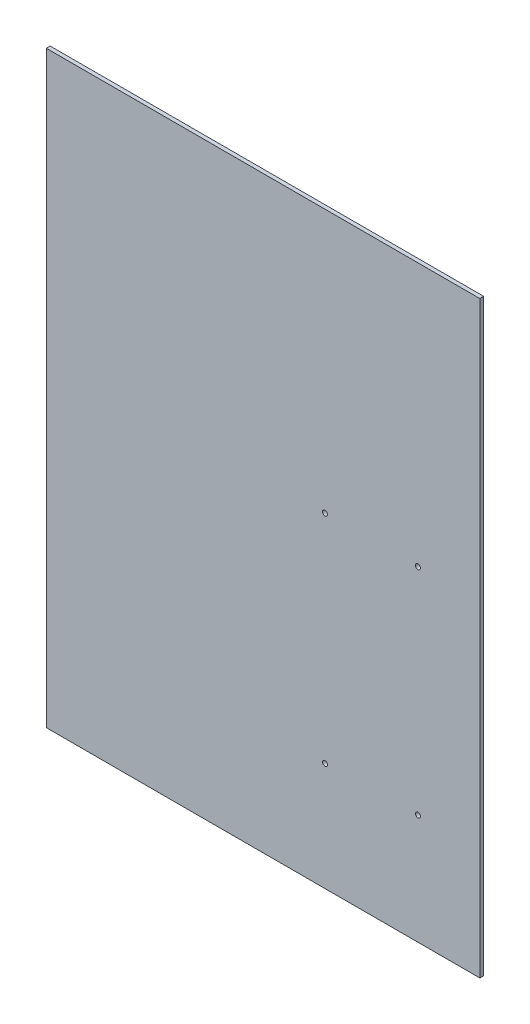
ISO-10303-21;
HEADER;
FILE_DESCRIPTION(('STEP AP214'),'2;1');
FILE_NAME('part.step','',(''),(''),'','','');
FILE_SCHEMA(('AUTOMOTIVE_DESIGN { 1 0 10303 214 1 1 1 1 }'));
ENDSEC;
DATA;
#1=APPLICATION_CONTEXT('core data for automotive mechanical design processes');
#2=APPLICATION_PROTOCOL_DEFINITION('international standard','automotive_design',2000,#1);
#3=PRODUCT_CONTEXT('',#1,'mechanical');
#4=PRODUCT('Part','Part','',(#3));
#5=PRODUCT_RELATED_PRODUCT_CATEGORY('part','',(#4));
#6=PRODUCT_DEFINITION_FORMATION('','',#4);
#7=PRODUCT_DEFINITION_CONTEXT('part definition',#1,'design');
#8=PRODUCT_DEFINITION('design','',#6,#7);
#9=PRODUCT_DEFINITION_SHAPE('','',#8);
#10=(LENGTH_UNIT() NAMED_UNIT(*) SI_UNIT(.MILLI.,.METRE.));
#11=(NAMED_UNIT(*) PLANE_ANGLE_UNIT() SI_UNIT($,.RADIAN.));
#12=(NAMED_UNIT(*) SI_UNIT($,.STERADIAN.) SOLID_ANGLE_UNIT());
#13=UNCERTAINTY_MEASURE_WITH_UNIT(LENGTH_MEASURE(1.E-05),#10,'distance_accuracy_value','');
#14=(GEOMETRIC_REPRESENTATION_CONTEXT(3) GLOBAL_UNCERTAINTY_ASSIGNED_CONTEXT((#13)) GLOBAL_UNIT_ASSIGNED_CONTEXT((#10,
#11,#12)) REPRESENTATION_CONTEXT('',''));
#15=CARTESIAN_POINT('',(0.,0.,0.));
#16=DIRECTION('',(0.,0.,1.));
#17=DIRECTION('',(1.,0.,0.));
#18=AXIS2_PLACEMENT_3D('',#15,#16,#17);
#19=CARTESIAN_POINT('',(-177.8,0.,0.));
#20=DIRECTION('',(0.,0.,1.));
#21=DIRECTION('',(1.,0.,0.));
#22=AXIS2_PLACEMENT_3D('',#19,#20,#21);
#23=PLANE('',#22);
#24=CARTESIAN_POINT('',(50.7998552883525,266.7,0.));
#25=DIRECTION('',(0.,0.,-1.));
#26=DIRECTION('',(-1.,0.,0.));
#27=AXIS2_PLACEMENT_3D('',#24,#25,#26);
#28=CIRCLE('',#27,2.01929999999999);
#29=CARTESIAN_POINT('',(48.7805552883525,266.7,0.));
#30=VERTEX_POINT('',#29);
#31=EDGE_CURVE('E148',#30,#30,#28,.T.);
#32=ORIENTED_EDGE('',*,*,#31,.F.);
#33=EDGE_LOOP('',(#32));
#34=FACE_BOUND('',#33,.T.);
#35=CARTESIAN_POINT('',(126.999855288353,90.3329647784213,0.));
#36=DIRECTION('',(0.,0.,-1.));
#37=DIRECTION('',(-1.,0.,0.));
#38=AXIS2_PLACEMENT_3D('',#35,#36,#37);
#39=CIRCLE('',#38,2.0193);
#40=CARTESIAN_POINT('',(124.980555288353,90.3329647784213,0.));
#41=VERTEX_POINT('',#40);
#42=EDGE_CURVE('E87',#41,#41,#39,.T.);
#43=ORIENTED_EDGE('',*,*,#42,.F.);
#44=EDGE_LOOP('',(#43));
#45=FACE_BOUND('',#44,.T.);
#46=DIRECTION('',(0.,-1.,0.));
#47=VECTOR('',#46,1.);
#48=CARTESIAN_POINT('',(-177.8,482.6,0.));
#49=LINE('',#48,#47);
#50=CARTESIAN_POINT('',(-177.8,482.6,0.));
#51=VERTEX_POINT('',#50);
#52=CARTESIAN_POINT('',(-177.8,0.,0.));
#53=VERTEX_POINT('',#52);
#54=EDGE_CURVE('E71',#51,#53,#49,.T.);
#55=ORIENTED_EDGE('',*,*,#54,.F.);
#56=DIRECTION('',(-1.,0.,0.));
#57=VECTOR('',#56,1.);
#58=CARTESIAN_POINT('',(-177.8,482.6,0.));
#59=LINE('',#58,#57);
#60=CARTESIAN_POINT('',(177.8,482.6,0.));
#61=VERTEX_POINT('',#60);
#62=EDGE_CURVE('E92',#61,#51,#59,.T.);
#63=ORIENTED_EDGE('',*,*,#62,.F.);
#64=DIRECTION('',(0.,1.,0.));
#65=VECTOR('',#64,1.);
#66=CARTESIAN_POINT('',(177.8,482.6,0.));
#67=LINE('',#66,#65);
#68=CARTESIAN_POINT('',(177.8,0.,0.));
#69=VERTEX_POINT('',#68);
#70=EDGE_CURVE('E72',#69,#61,#67,.T.);
#71=ORIENTED_EDGE('',*,*,#70,.F.);
#72=DIRECTION('',(1.,0.,0.));
#73=VECTOR('',#72,1.);
#74=CARTESIAN_POINT('',(-177.8,0.,0.));
#75=LINE('',#74,#73);
#76=EDGE_CURVE('E67',#53,#69,#75,.T.);
#77=ORIENTED_EDGE('',*,*,#76,.F.);
#78=EDGE_LOOP('',(#55,#63,#71,#77));
#79=FACE_BOUND('',#78,.T.);
#80=CARTESIAN_POINT('',(50.7998552883525,88.9,0.));
#81=DIRECTION('',(0.,0.,-1.));
#82=DIRECTION('',(-1.,0.,0.));
#83=AXIS2_PLACEMENT_3D('',#80,#81,#82);
#84=CIRCLE('',#83,2.01929999999999);
#85=CARTESIAN_POINT('',(48.7805552883525,88.9,0.));
#86=VERTEX_POINT('',#85);
#87=EDGE_CURVE('E157',#86,#86,#84,.T.);
#88=ORIENTED_EDGE('',*,*,#87,.F.);
#89=EDGE_LOOP('',(#88));
#90=FACE_BOUND('',#89,.T.);
#91=CARTESIAN_POINT('',(126.999855288353,266.7,0.));
#92=DIRECTION('',(0.,0.,-1.));
#93=DIRECTION('',(-1.,0.,0.));
#94=AXIS2_PLACEMENT_3D('',#91,#92,#93);
#95=CIRCLE('',#94,2.01929999999997);
#96=CARTESIAN_POINT('',(124.980555288353,266.7,0.));
#97=VERTEX_POINT('',#96);
#98=EDGE_CURVE('E145',#97,#97,#95,.T.);
#99=ORIENTED_EDGE('',*,*,#98,.F.);
#100=EDGE_LOOP('',(#99));
#101=FACE_BOUND('',#100,.T.);
#102=ADVANCED_FACE('F26',(#34,#45,#79,#90,#101),#23,.F.);
#103=CARTESIAN_POINT('',(-177.8,482.6,3.175));
#104=DIRECTION('',(1.,0.,0.));
#105=DIRECTION('',(0.,1.,0.));
#106=AXIS2_PLACEMENT_3D('',#103,#104,#105);
#107=PLANE('',#106);
#108=ORIENTED_EDGE('',*,*,#54,.T.);
#109=DIRECTION('',(0.,0.,-1.));
#110=VECTOR('',#109,1.);
#111=CARTESIAN_POINT('',(-177.8,0.,3.175));
#112=LINE('',#111,#110);
#113=CARTESIAN_POINT('',(-177.8,0.,3.175));
#114=VERTEX_POINT('',#113);
#115=EDGE_CURVE('E11',#114,#53,#112,.T.);
#116=ORIENTED_EDGE('',*,*,#115,.F.);
#117=DIRECTION('',(0.,-1.,0.));
#118=VECTOR('',#117,1.);
#119=CARTESIAN_POINT('',(-177.8,482.6,3.175));
#120=LINE('',#119,#118);
#121=CARTESIAN_POINT('',(-177.8,482.6,3.175));
#122=VERTEX_POINT('',#121);
#123=EDGE_CURVE('E94',#122,#114,#120,.T.);
#124=ORIENTED_EDGE('',*,*,#123,.F.);
#125=DIRECTION('',(0.,0.,-1.));
#126=VECTOR('',#125,1.);
#127=CARTESIAN_POINT('',(-177.8,482.6,3.175));
#128=LINE('',#127,#126);
#129=EDGE_CURVE('E83',#122,#51,#128,.T.);
#130=ORIENTED_EDGE('',*,*,#129,.T.);
#131=EDGE_LOOP('',(#108,#116,#124,#130));
#132=FACE_BOUND('',#131,.T.);
#133=ADVANCED_FACE('F28',(#132),#107,.F.);
#134=CARTESIAN_POINT('',(-177.8,0.,3.175));
#135=DIRECTION('',(0.,1.,0.));
#136=DIRECTION('',(0.,0.,1.));
#137=AXIS2_PLACEMENT_3D('',#134,#135,#136);
#138=PLANE('',#137);
#139=ORIENTED_EDGE('',*,*,#76,.T.);
#140=DIRECTION('',(0.,0.,-1.));
#141=VECTOR('',#140,1.);
#142=CARTESIAN_POINT('',(177.8,0.,3.175));
#143=LINE('',#142,#141);
#144=CARTESIAN_POINT('',(177.8,0.,3.175));
#145=VERTEX_POINT('',#144);
#146=EDGE_CURVE('E34',#145,#69,#143,.T.);
#147=ORIENTED_EDGE('',*,*,#146,.F.);
#148=DIRECTION('',(1.,0.,0.));
#149=VECTOR('',#148,1.);
#150=CARTESIAN_POINT('',(-177.8,0.,3.175));
#151=LINE('',#150,#149);
#152=EDGE_CURVE('E79',#114,#145,#151,.T.);
#153=ORIENTED_EDGE('',*,*,#152,.F.);
#154=ORIENTED_EDGE('',*,*,#115,.T.);
#155=EDGE_LOOP('',(#139,#147,#153,#154));
#156=FACE_BOUND('',#155,.T.);
#157=ADVANCED_FACE('F78',(#156),#138,.F.);
#158=CARTESIAN_POINT('',(177.8,482.6,3.175));
#159=DIRECTION('',(-1.,0.,0.));
#160=DIRECTION('',(0.,-1.,0.));
#161=AXIS2_PLACEMENT_3D('',#158,#159,#160);
#162=PLANE('',#161);
#163=ORIENTED_EDGE('',*,*,#70,.T.);
#164=DIRECTION('',(0.,0.,-1.));
#165=VECTOR('',#164,1.);
#166=CARTESIAN_POINT('',(177.8,482.6,3.175));
#167=LINE('',#166,#165);
#168=CARTESIAN_POINT('',(177.8,482.6,3.175));
#169=VERTEX_POINT('',#168);
#170=EDGE_CURVE('E100',#169,#61,#167,.T.);
#171=ORIENTED_EDGE('',*,*,#170,.F.);
#172=DIRECTION('',(0.,1.,0.));
#173=VECTOR('',#172,1.);
#174=CARTESIAN_POINT('',(177.8,482.6,3.175));
#175=LINE('',#174,#173);
#176=EDGE_CURVE('E46',#145,#169,#175,.T.);
#177=ORIENTED_EDGE('',*,*,#176,.F.);
#178=ORIENTED_EDGE('',*,*,#146,.T.);
#179=EDGE_LOOP('',(#163,#171,#177,#178));
#180=FACE_BOUND('',#179,.T.);
#181=ADVANCED_FACE('F103',(#180),#162,.F.);
#182=CARTESIAN_POINT('',(-177.8,482.6,3.175));
#183=DIRECTION('',(0.,-1.,0.));
#184=DIRECTION('',(0.,0.,-1.));
#185=AXIS2_PLACEMENT_3D('',#182,#183,#184);
#186=PLANE('',#185);
#187=ORIENTED_EDGE('',*,*,#62,.T.);
#188=ORIENTED_EDGE('',*,*,#129,.F.);
#189=DIRECTION('',(-1.,0.,0.));
#190=VECTOR('',#189,1.);
#191=CARTESIAN_POINT('',(-177.8,482.6,3.175));
#192=LINE('',#191,#190);
#193=EDGE_CURVE('E41',#169,#122,#192,.T.);
#194=ORIENTED_EDGE('',*,*,#193,.F.);
#195=ORIENTED_EDGE('',*,*,#170,.T.);
#196=EDGE_LOOP('',(#187,#188,#194,#195));
#197=FACE_BOUND('',#196,.T.);
#198=ADVANCED_FACE('F105',(#197),#186,.F.);
#199=CARTESIAN_POINT('',(-177.8,0.,3.175));
#200=DIRECTION('',(0.,0.,1.));
#201=DIRECTION('',(1.,0.,0.));
#202=AXIS2_PLACEMENT_3D('',#199,#200,#201);
#203=PLANE('',#202);
#204=CARTESIAN_POINT('',(126.999855288353,266.7,3.175));
#205=DIRECTION('',(0.,0.,1.));
#206=DIRECTION('',(1.,0.,0.));
#207=AXIS2_PLACEMENT_3D('',#204,#205,#206);
#208=CIRCLE('',#207,2.01929999999999);
#209=CARTESIAN_POINT('',(129.019155288352,266.7,3.175));
#210=VERTEX_POINT('',#209);
#211=EDGE_CURVE('E147',#210,#210,#208,.T.);
#212=ORIENTED_EDGE('',*,*,#211,.F.);
#213=EDGE_LOOP('',(#212));
#214=FACE_BOUND('',#213,.T.);
#215=CARTESIAN_POINT('',(50.7998552883525,266.7,3.175));
#216=DIRECTION('',(0.,0.,1.));
#217=DIRECTION('',(1.,0.,0.));
#218=AXIS2_PLACEMENT_3D('',#215,#216,#217);
#219=CIRCLE('',#218,2.01929999999999);
#220=CARTESIAN_POINT('',(52.8191552883525,266.7,3.175));
#221=VERTEX_POINT('',#220);
#222=EDGE_CURVE('E151',#221,#221,#219,.T.);
#223=ORIENTED_EDGE('',*,*,#222,.F.);
#224=EDGE_LOOP('',(#223));
#225=FACE_BOUND('',#224,.T.);
#226=CARTESIAN_POINT('',(50.7998552883525,88.9,3.175));
#227=DIRECTION('',(0.,0.,1.));
#228=DIRECTION('',(1.,0.,0.));
#229=AXIS2_PLACEMENT_3D('',#226,#227,#228);
#230=CIRCLE('',#229,2.01929999999999);
#231=CARTESIAN_POINT('',(52.8191552883525,88.9,3.175));
#232=VERTEX_POINT('',#231);
#233=EDGE_CURVE('E160',#232,#232,#230,.T.);
#234=ORIENTED_EDGE('',*,*,#233,.F.);
#235=EDGE_LOOP('',(#234));
#236=FACE_BOUND('',#235,.T.);
#237=CARTESIAN_POINT('',(126.999855288353,90.3329647784213,3.175));
#238=DIRECTION('',(0.,0.,1.));
#239=DIRECTION('',(1.,0.,0.));
#240=AXIS2_PLACEMENT_3D('',#237,#238,#239);
#241=CIRCLE('',#240,2.0193);
#242=CARTESIAN_POINT('',(129.019155288353,90.3329647784213,3.175));
#243=VERTEX_POINT('',#242);
#244=EDGE_CURVE('E84',#243,#243,#241,.T.);
#245=ORIENTED_EDGE('',*,*,#244,.F.);
#246=EDGE_LOOP('',(#245));
#247=FACE_BOUND('',#246,.T.);
#248=ORIENTED_EDGE('',*,*,#123,.T.);
#249=ORIENTED_EDGE('',*,*,#152,.T.);
#250=ORIENTED_EDGE('',*,*,#176,.T.);
#251=ORIENTED_EDGE('',*,*,#193,.T.);
#252=EDGE_LOOP('',(#248,#249,#250,#251));
#253=FACE_BOUND('',#252,.T.);
#254=ADVANCED_FACE('F106',(#214,#225,#236,#247,#253),#203,.T.);
#255=CARTESIAN_POINT('',(126.999855288353,90.3329647784213,0.));
#256=DIRECTION('',(0.,0.,-1.));
#257=DIRECTION('',(-1.,0.,0.));
#258=AXIS2_PLACEMENT_3D('',#255,#256,#257);
#259=CYLINDRICAL_SURFACE('',#258,2.0193);
#260=ORIENTED_EDGE('',*,*,#42,.T.);
#261=EDGE_LOOP('',(#260));
#262=FACE_BOUND('',#261,.T.);
#263=ORIENTED_EDGE('',*,*,#244,.T.);
#264=EDGE_LOOP('',(#263));
#265=FACE_BOUND('',#264,.T.);
#266=ADVANCED_FACE('F108',(#262,#265),#259,.F.);
#267=CARTESIAN_POINT('',(50.7998552883525,88.9,0.));
#268=DIRECTION('',(0.,0.,-1.));
#269=DIRECTION('',(-1.,0.,0.));
#270=AXIS2_PLACEMENT_3D('',#267,#268,#269);
#271=CYLINDRICAL_SURFACE('',#270,2.01929999999999);
#272=ORIENTED_EDGE('',*,*,#87,.T.);
#273=EDGE_LOOP('',(#272));
#274=FACE_BOUND('',#273,.T.);
#275=ORIENTED_EDGE('',*,*,#233,.T.);
#276=EDGE_LOOP('',(#275));
#277=FACE_BOUND('',#276,.T.);
#278=ADVANCED_FACE('F115',(#274,#277),#271,.F.);
#279=CARTESIAN_POINT('',(50.7998552883525,266.7,0.));
#280=DIRECTION('',(0.,0.,-1.));
#281=DIRECTION('',(-1.,0.,0.));
#282=AXIS2_PLACEMENT_3D('',#279,#280,#281);
#283=CYLINDRICAL_SURFACE('',#282,2.01929999999999);
#284=ORIENTED_EDGE('',*,*,#31,.T.);
#285=EDGE_LOOP('',(#284));
#286=FACE_BOUND('',#285,.T.);
#287=ORIENTED_EDGE('',*,*,#222,.T.);
#288=EDGE_LOOP('',(#287));
#289=FACE_BOUND('',#288,.T.);
#290=ADVANCED_FACE('F132',(#286,#289),#283,.F.);
#291=CARTESIAN_POINT('',(126.999855288353,266.7,0.));
#292=DIRECTION('',(0.,0.,-1.));
#293=DIRECTION('',(-1.,0.,0.));
#294=AXIS2_PLACEMENT_3D('',#291,#292,#293);
#295=CYLINDRICAL_SURFACE('',#294,2.01929999999999);
#296=ORIENTED_EDGE('',*,*,#98,.T.);
#297=EDGE_LOOP('',(#296));
#298=FACE_BOUND('',#297,.T.);
#299=ORIENTED_EDGE('',*,*,#211,.T.);
#300=EDGE_LOOP('',(#299));
#301=FACE_BOUND('',#300,.T.);
#302=ADVANCED_FACE('F136',(#298,#301),#295,.F.);
#303=CLOSED_SHELL('',(#102,#133,#157,#181,#198,#254,#266,#278,#290,#302));
#304=MANIFOLD_SOLID_BREP('B2',#303);
#305=ADVANCED_BREP_SHAPE_REPRESENTATION('',(#18,#304),#14);
#306=SHAPE_DEFINITION_REPRESENTATION(#9,#305);
ENDSEC;
END-ISO-10303-21;
